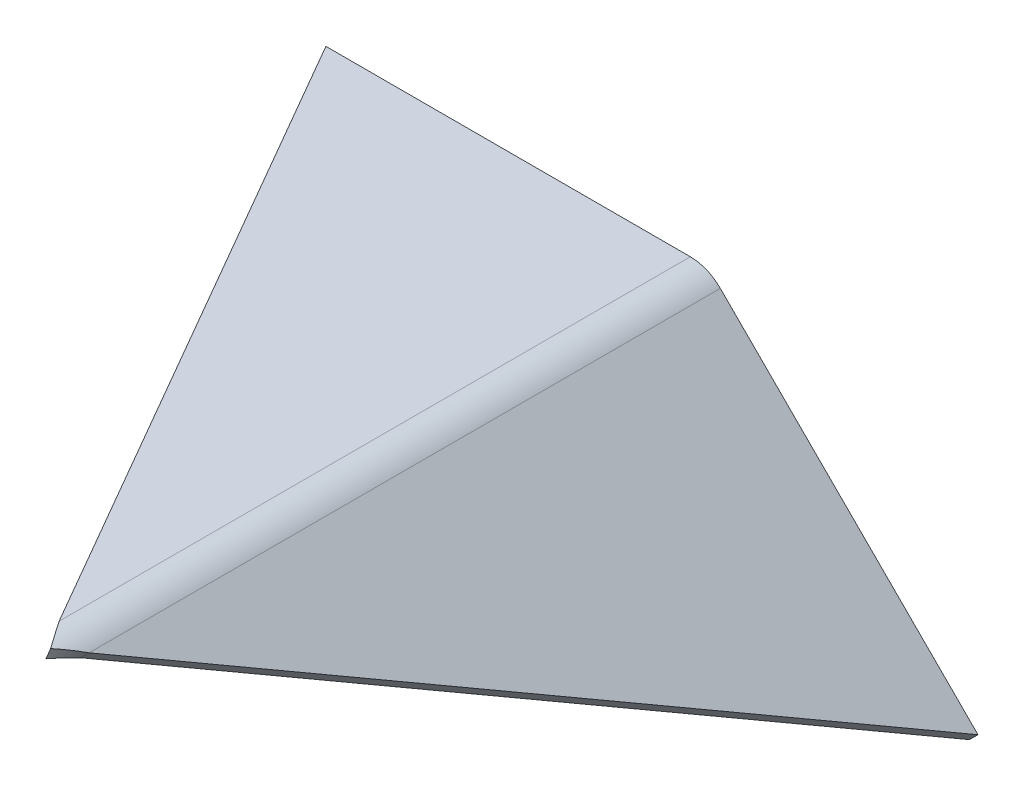
ISO-10303-21;
HEADER;
FILE_DESCRIPTION(('STEP AP214'),'2;1');
FILE_NAME('part.step','',(''),(''),'','','');
FILE_SCHEMA(('AUTOMOTIVE_DESIGN { 1 0 10303 214 1 1 1 1 }'));
ENDSEC;
DATA;
#1=APPLICATION_CONTEXT('core data for automotive mechanical design processes');
#2=APPLICATION_PROTOCOL_DEFINITION('international standard','automotive_design',2000,#1);
#3=PRODUCT_CONTEXT('',#1,'mechanical');
#4=PRODUCT('Part','Part','',(#3));
#5=PRODUCT_RELATED_PRODUCT_CATEGORY('part','',(#4));
#6=PRODUCT_DEFINITION_FORMATION('','',#4);
#7=PRODUCT_DEFINITION_CONTEXT('part definition',#1,'design');
#8=PRODUCT_DEFINITION('design','',#6,#7);
#9=PRODUCT_DEFINITION_SHAPE('','',#8);
#10=(LENGTH_UNIT() NAMED_UNIT(*) SI_UNIT(.MILLI.,.METRE.));
#11=(NAMED_UNIT(*) PLANE_ANGLE_UNIT() SI_UNIT($,.RADIAN.));
#12=(NAMED_UNIT(*) SI_UNIT($,.STERADIAN.) SOLID_ANGLE_UNIT());
#13=UNCERTAINTY_MEASURE_WITH_UNIT(LENGTH_MEASURE(1.E-05),#10,'distance_accuracy_value','');
#14=(GEOMETRIC_REPRESENTATION_CONTEXT(3) GLOBAL_UNCERTAINTY_ASSIGNED_CONTEXT((#13)) GLOBAL_UNIT_ASSIGNED_CONTEXT((#10,
#11,#12)) REPRESENTATION_CONTEXT('',''));
#15=CARTESIAN_POINT('',(0.,0.,0.));
#16=DIRECTION('',(0.,0.,1.));
#17=DIRECTION('',(1.,0.,0.));
#18=AXIS2_PLACEMENT_3D('',#15,#16,#17);
#19=CARTESIAN_POINT('',(90.2432914009265,-89.1566905080881,-216.50635094611));
#20=DIRECTION('',(-0.612372435695794,0.612372435695796,-0.5));
#21=DIRECTION('',(0.353553390593273,-0.353553390593274,-0.866025403784439));
#22=AXIS2_PLACEMENT_3D('',#19,#20,#21);
#23=PLANE('',#22);
#24=CARTESIAN_POINT('',(2.35867883148077,-6.92893218813451,-8.16209713905391));
#25=CARTESIAN_POINT('',(5.18710595622695,-4.10050506338832,-8.16209713905391));
#26=B_SPLINE_CURVE_WITH_KNOTS('',1,(#24,#25),.UNSPECIFIED.,.F.,.F.,(2,2),(0.,1.),.UNSPECIFIED.);
#27=CARTESIAN_POINT('',(2.35867883148075,-6.92893218813454,-8.16209713905391));
#28=VERTEX_POINT('',#27);
#29=CARTESIAN_POINT('',(5.18710595622697,-4.10050506338834,-8.16209713905391));
#30=VERTEX_POINT('',#29);
#31=EDGE_CURVE('E11',#28,#30,#26,.T.);
#32=ORIENTED_EDGE('',*,*,#31,.F.);
#33=DIRECTION('',(0.353553390593273,-0.353553390593274,-0.866025403784439));
#34=VECTOR('',#33,1.);
#35=CARTESIAN_POINT('',(87.4148642761803,-91.9851176328343,-216.50635094611));
#36=LINE('',#35,#34);
#37=CARTESIAN_POINT('',(87.4148642761803,-91.9851176328343,-216.50635094611));
#38=VERTEX_POINT('',#37);
#39=EDGE_CURVE('E96',#28,#38,#36,.T.);
#40=ORIENTED_EDGE('',*,*,#39,.T.);
#41=DIRECTION('',(0.707106781186549,0.707106781186546,0.));
#42=VECTOR('',#41,1.);
#43=CARTESIAN_POINT('',(90.2432914009265,-89.1566905080881,-216.50635094611));
#44=LINE('',#43,#42);
#45=CARTESIAN_POINT('',(90.2432914009265,-89.1566905080881,-216.50635094611));
#46=VERTEX_POINT('',#45);
#47=EDGE_CURVE('E57',#38,#46,#44,.T.);
#48=ORIENTED_EDGE('',*,*,#47,.T.);
#49=DIRECTION('',(0.353553390593273,-0.353553390593274,-0.866025403784439));
#50=VECTOR('',#49,1.);
#51=CARTESIAN_POINT('',(90.2432914009265,-89.1566905080881,-216.50635094611));
#52=LINE('',#51,#50);
#53=EDGE_CURVE('E99',#30,#46,#52,.T.);
#54=ORIENTED_EDGE('',*,*,#53,.F.);
#55=EDGE_LOOP('',(#32,#40,#48,#54));
#56=FACE_BOUND('',#55,.T.);
#57=ADVANCED_FACE('F43',(#56),#23,.F.);
#58=CARTESIAN_POINT('',(-86.5334038957101,87.620004788549,-216.50635094611));
#59=DIRECTION('',(0.,0.,1.));
#60=DIRECTION('',(-0.707106781186546,0.707106781186549,0.));
#61=AXIS2_PLACEMENT_3D('',#58,#59,#60);
#62=PLANE('',#61);
#63=ORIENTED_EDGE('',*,*,#47,.F.);
#64=DIRECTION('',(0.707106781186546,-0.707106781186549,0.));
#65=VECTOR('',#64,1.);
#66=CARTESIAN_POINT('',(-0.973483372138,-3.59676998451578,-216.50635094611));
#67=LINE('',#66,#65);
#68=CARTESIAN_POINT('',(2.35867883148078,-6.92893218813453,-216.50635094611));
#69=VERTEX_POINT('',#68);
#70=EDGE_CURVE('E126',#38,#69,#67,.F.);
#71=ORIENTED_EDGE('',*,*,#70,.T.);
#72=DIRECTION('',(0.707106781186548,0.707106781186547,0.));
#73=VECTOR('',#72,1.);
#74=CARTESIAN_POINT('',(5.18710595622697,-4.10050506338834,-216.50635094611));
#75=LINE('',#74,#73);
#76=CARTESIAN_POINT('',(5.18710595622697,-4.10050506338834,-216.50635094611));
#77=VERTEX_POINT('',#76);
#78=EDGE_CURVE('E412',#69,#77,#75,.T.);
#79=ORIENTED_EDGE('',*,*,#78,.T.);
#80=DIRECTION('',(-0.707106781186546,0.707106781186549,0.));
#81=VECTOR('',#80,1.);
#82=CARTESIAN_POINT('',(-86.5334038957101,87.620004788549,-216.50635094611));
#83=LINE('',#82,#81);
#84=EDGE_CURVE('E392',#46,#77,#83,.T.);
#85=ORIENTED_EDGE('',*,*,#84,.F.);
#86=EDGE_LOOP('',(#63,#71,#79,#85));
#87=FACE_BOUND('',#86,.T.);
#88=ADVANCED_FACE('F178',(#87),#62,.F.);
#89=CARTESIAN_POINT('',(-4.7123889803847,-14.,-216.50635094611));
#90=DIRECTION('',(0.,0.,-1.));
#91=DIRECTION('',(-1.,0.,0.));
#92=AXIS2_PLACEMENT_3D('',#89,#90,#91);
#93=PLANE('',#92);
#94=ORIENTED_EDGE('',*,*,#78,.F.);
#95=CARTESIAN_POINT('',(-4.7123889803847,-14.,-216.50635094611));
#96=DIRECTION('',(0.,0.,1.));
#97=DIRECTION('',(1.,0.,0.));
#98=AXIS2_PLACEMENT_3D('',#95,#96,#97);
#99=CIRCLE('',#98,10.);
#100=CARTESIAN_POINT('',(-4.7123889803847,-4.,-216.50635094611));
#101=VERTEX_POINT('',#100);
#102=EDGE_CURVE('E119',#101,#69,#99,.F.);
#103=ORIENTED_EDGE('',*,*,#102,.F.);
#104=DIRECTION('',(0.,1.,0.));
#105=VECTOR('',#104,1.);
#106=CARTESIAN_POINT('',(-4.7123889803847,0.,-216.50635094611));
#107=LINE('',#106,#105);
#108=CARTESIAN_POINT('',(-4.7123889803847,0.,-216.50635094611));
#109=VERTEX_POINT('',#108);
#110=EDGE_CURVE('E409',#101,#109,#107,.T.);
#111=ORIENTED_EDGE('',*,*,#110,.T.);
#112=CARTESIAN_POINT('',(-4.7123889803847,-14.,-216.50635094611));
#113=DIRECTION('',(0.,0.,1.));
#114=DIRECTION('',(1.,0.,0.));
#115=AXIS2_PLACEMENT_3D('',#112,#113,#114);
#116=CIRCLE('',#115,14.);
#117=EDGE_CURVE('E389',#109,#77,#116,.F.);
#118=ORIENTED_EDGE('',*,*,#117,.T.);
#119=EDGE_LOOP('',(#94,#103,#111,#118));
#120=FACE_BOUND('',#119,.T.);
#121=ADVANCED_FACE('F174',(#120),#93,.T.);
#122=CARTESIAN_POINT('',(-125.,0.,-216.50635094611));
#123=DIRECTION('',(0.,0.,1.));
#124=DIRECTION('',(-1.,0.,0.));
#125=AXIS2_PLACEMENT_3D('',#122,#123,#124);
#126=PLANE('',#125);
#127=ORIENTED_EDGE('',*,*,#110,.F.);
#128=DIRECTION('',(1.,0.,0.));
#129=VECTOR('',#128,1.);
#130=CARTESIAN_POINT('',(0.,-4.,-216.50635094611));
#131=LINE('',#130,#129);
#132=CARTESIAN_POINT('',(-125.,-4.,-216.50635094611));
#133=VERTEX_POINT('',#132);
#134=EDGE_CURVE('E123',#101,#133,#131,.F.);
#135=ORIENTED_EDGE('',*,*,#134,.T.);
#136=DIRECTION('',(0.,1.,0.));
#137=VECTOR('',#136,1.);
#138=CARTESIAN_POINT('',(-125.,0.,-216.50635094611));
#139=LINE('',#138,#137);
#140=CARTESIAN_POINT('',(-125.,0.,-216.50635094611));
#141=VERTEX_POINT('',#140);
#142=EDGE_CURVE('E403',#133,#141,#139,.T.);
#143=ORIENTED_EDGE('',*,*,#142,.T.);
#144=DIRECTION('',(-1.,0.,0.));
#145=VECTOR('',#144,1.);
#146=CARTESIAN_POINT('',(-125.,0.,-216.50635094611));
#147=LINE('',#146,#145);
#148=EDGE_CURVE('E434',#109,#141,#147,.T.);
#149=ORIENTED_EDGE('',*,*,#148,.F.);
#150=EDGE_LOOP('',(#127,#135,#143,#149));
#151=FACE_BOUND('',#150,.T.);
#152=ADVANCED_FACE('F167',(#151),#126,.F.);
#153=CARTESIAN_POINT('',(0.,0.,0.));
#154=DIRECTION('',(0.866025403784438,0.,-0.5));
#155=DIRECTION('',(0.5,0.,0.866025403784439));
#156=AXIS2_PLACEMENT_3D('',#153,#154,#155);
#157=PLANE('',#156);
#158=ORIENTED_EDGE('',*,*,#142,.F.);
#159=DIRECTION('',(0.5,0.,0.866025403784439));
#160=VECTOR('',#159,1.);
#161=CARTESIAN_POINT('',(0.,-4.,0.));
#162=LINE('',#161,#160);
#163=CARTESIAN_POINT('',(-4.7123889803847,-4.,-8.16209713905399));
#164=VERTEX_POINT('',#163);
#165=EDGE_CURVE('E357',#133,#164,#162,.T.);
#166=ORIENTED_EDGE('',*,*,#165,.T.);
#167=CARTESIAN_POINT('',(-4.7123889803847,0.,-8.16209713905397));
#168=CARTESIAN_POINT('',(-4.7123889803847,-4.,-8.16209713905397));
#169=B_SPLINE_CURVE_WITH_KNOTS('',1,(#167,#168),.UNSPECIFIED.,.F.,.F.,(2,2),(0.,1.),.UNSPECIFIED.);
#170=CARTESIAN_POINT('',(-4.7123889803847,0.,-8.16209713905399));
#171=VERTEX_POINT('',#170);
#172=EDGE_CURVE('E149',#164,#171,#169,.F.);
#173=ORIENTED_EDGE('',*,*,#172,.T.);
#174=DIRECTION('',(0.5,0.,0.866025403784439));
#175=VECTOR('',#174,1.);
#176=CARTESIAN_POINT('',(0.,0.,0.));
#177=LINE('',#176,#175);
#178=EDGE_CURVE('E411',#141,#171,#177,.T.);
#179=ORIENTED_EDGE('',*,*,#178,.F.);
#180=EDGE_LOOP('',(#158,#166,#173,#179));
#181=FACE_BOUND('',#180,.T.);
#182=ADVANCED_FACE('F156',(#181),#157,.F.);
#183=CARTESIAN_POINT('',(0.645179014249225,-1.06568652061988,-9.39693323154245E-08));
#184=CARTESIAN_POINT('',(-1.04827574731532,-0.364234600084442,-2.72127295505337));
#185=CARTESIAN_POINT('',(-2.87940675835187,0.,-5.44082427796996));
#186=CARTESIAN_POINT('',(-4.7123889803847,0.,-8.16209713905397));
#187=CARTESIAN_POINT('',(-0.885554698503325,-4.76120465758563,-9.39693323154245E-08));
#188=CARTESIAN_POINT('',(-2.09506798963428,-4.26020785493522,-2.72105416436443));
#189=CARTESIAN_POINT('',(-3.40322123036626,-4.,-5.4410430686589));
#190=CARTESIAN_POINT('',(-4.7123889803847,-4.,-8.16209713905397));
#191=B_SPLINE_SURFACE_WITH_KNOTS('',1,3,((#183,#184,#185,#186),(#187,#188,#189,#190)),
.UNSPECIFIED.,.F.,.F.,.F.,(2,2),(4,4),(0.,1.),(1.15128904621129E-08,1.),.UNSPECIFIED.);
#192=CARTESIAN_POINT('',(-4.7123889803847,-4.,-8.16209713905397));
#193=CARTESIAN_POINT('',(-3.40322123036626,-4.,-5.4410430686589));
#194=CARTESIAN_POINT('',(-2.09506798963428,-4.26020785493522,-2.72105416436443));
#195=CARTESIAN_POINT('',(-0.885554698503325,-4.76120465758563,-9.39693323154245E-08));
#196=B_SPLINE_CURVE_WITH_KNOTS('',3,(#192,#193,#194,#195),.UNSPECIFIED.,.F.,.F.,(4,4),
(1.15128904187856E-08,1.),.UNSPECIFIED.);
#197=CARTESIAN_POINT('',(-0.885554545584359,-4.76120472092674,-2.5005397752409E-07));
#198=VERTEX_POINT('',#197);
#199=EDGE_CURVE('E129',#198,#164,#196,.F.);
#200=CARTESIAN_POINT('',(-0.885554698503325,-4.76120465758563,-9.39693323154245E-08));
#201=CARTESIAN_POINT('',(0.645179014249225,-1.06568652061988,-9.39693323154245E-08));
#202=B_SPLINE_CURVE_WITH_KNOTS('',1,(#200,#201),.UNSPECIFIED.,.F.,.F.,(2,2),(0.,1.),.UNSPECIFIED.);
#203=CARTESIAN_POINT('',(0.645179228335777,-1.06568660929744,-2.5005397752409E-07));
#204=VERTEX_POINT('',#203);
#205=EDGE_CURVE('E65',#198,#204,#202,.T.);
#206=CARTESIAN_POINT('',(0.645179014249225,-1.06568652061988,-9.39693323154245E-08));
#207=CARTESIAN_POINT('',(-1.04827574731532,-0.364234600084442,-2.72127295505337));
#208=CARTESIAN_POINT('',(-2.87940675835187,0.,-5.44082427796996));
#209=CARTESIAN_POINT('',(-4.7123889803847,0.,-8.16209713905397));
#210=B_SPLINE_CURVE_WITH_KNOTS('',3,(#206,#207,#208,#209),.UNSPECIFIED.,.F.,.F.,(4,4),
(1.15128904621129E-08,1.),.UNSPECIFIED.);
#211=EDGE_CURVE('E368',#204,#171,#210,.T.);
#212=ORIENTED_EDGE('',*,*,#172,.F.);
#213=ORIENTED_EDGE('',*,*,#199,.F.);
#214=ORIENTED_EDGE('',*,*,#205,.T.);
#215=ORIENTED_EDGE('',*,*,#211,.T.);
#216=EDGE_LOOP('',(#212,#213,#214,#215));
#217=FACE_BOUND('',#216,.T.);
#218=ADVANCED_FACE('F166',(#217),#191,.F.);
#219=CARTESIAN_POINT('',(5.18710595622695,-4.10050506338832,-8.16209713905391));
#220=CARTESIAN_POINT('',(3.890991822039,-2.80439092920037,-5.44082433005133));
#221=CARTESIAN_POINT('',(2.33863394587959,-1.76713854443782,-2.72127305905658));
#222=CARTESIAN_POINT('',(0.645179228335772,-1.06568660929743,-2.5005397752409E-07));
#223=CARTESIAN_POINT('',(2.35867883148077,-6.92893218813451,-8.16209713905391));
#224=CARTESIAN_POINT('',(1.43295745544367,-6.00321081209742,-5.44104312072033));
#225=CARTESIAN_POINT('',(0.323958714112757,-5.26220153401132,-2.72105426838759));
#226=CARTESIAN_POINT('',(-0.885554545584363,-4.76120472092674,-2.5005397752409E-07));
#227=B_SPLINE_SURFACE_WITH_KNOTS('',1,3,((#219,#220,#221,#222),(#223,#224,#225,#226)),
.UNSPECIFIED.,.F.,.F.,.F.,(2,2),(4,4),(0.,1.),(0.,0.999999969364003),.UNSPECIFIED.);
#228=CARTESIAN_POINT('',(-0.885554545584363,-4.76120472092674,-2.5005397752409E-07));
#229=CARTESIAN_POINT('',(0.323958714112757,-5.26220153401132,-2.72105426838759));
#230=CARTESIAN_POINT('',(1.43295745544367,-6.00321081209742,-5.44104312072033));
#231=CARTESIAN_POINT('',(2.35867883148077,-6.92893218813451,-8.16209713905391));
#232=B_SPLINE_CURVE_WITH_KNOTS('',3,(#228,#229,#230,#231),.UNSPECIFIED.,.F.,.F.,(4,4),(0.,
0.999999969364003),.UNSPECIFIED.);
#233=EDGE_CURVE('E116',#28,#198,#232,.F.);
#234=CARTESIAN_POINT('',(5.18710595622695,-4.10050506338832,-8.16209713905391));
#235=CARTESIAN_POINT('',(3.890991822039,-2.80439092920037,-5.44082433005133));
#236=CARTESIAN_POINT('',(2.33863394587959,-1.76713854443782,-2.72127305905658));
#237=CARTESIAN_POINT('',(0.645179228335772,-1.06568660929743,-2.5005397752409E-07));
#238=B_SPLINE_CURVE_WITH_KNOTS('',3,(#234,#235,#236,#237),.UNSPECIFIED.,.F.,.F.,(4,4),(0.,
0.999999969364003),.UNSPECIFIED.);
#239=EDGE_CURVE('E386',#30,#204,#238,.T.);
#240=ORIENTED_EDGE('',*,*,#233,.F.);
#241=ORIENTED_EDGE('',*,*,#31,.T.);
#242=ORIENTED_EDGE('',*,*,#239,.T.);
#243=ORIENTED_EDGE('',*,*,#205,.F.);
#244=EDGE_LOOP('',(#240,#241,#242,#243));
#245=FACE_BOUND('',#244,.T.);
#246=ADVANCED_FACE('F45',(#245),#227,.F.);
#247=CARTESIAN_POINT('',(-4.7123889803847,-14.,-329.082526088088));
#248=DIRECTION('',(0.,0.,1.));
#249=DIRECTION('',(1.,0.,0.));
#250=AXIS2_PLACEMENT_3D('',#247,#248,#249);
#251=CYLINDRICAL_SURFACE('',#250,14.);
#252=DIRECTION('',(0.,0.,-1.));
#253=VECTOR('',#252,1.);
#254=CARTESIAN_POINT('',(-4.7123889803847,0.,0.));
#255=LINE('',#254,#253);
#256=EDGE_CURVE('E436',#171,#109,#255,.T.);
#257=ORIENTED_EDGE('',*,*,#256,.F.);
#258=ORIENTED_EDGE('',*,*,#211,.F.);
#259=ORIENTED_EDGE('',*,*,#239,.F.);
#260=DIRECTION('',(0.,0.,-1.));
#261=VECTOR('',#260,1.);
#262=CARTESIAN_POINT('',(5.18710595622697,-4.10050506338838,0.));
#263=LINE('',#262,#261);
#264=EDGE_CURVE('E396',#30,#77,#263,.T.);
#265=ORIENTED_EDGE('',*,*,#264,.T.);
#266=ORIENTED_EDGE('',*,*,#117,.F.);
#267=EDGE_LOOP('',(#257,#258,#259,#265,#266));
#268=FACE_BOUND('',#267,.T.);
#269=ADVANCED_FACE('F232',(#268),#251,.T.);
#270=CARTESIAN_POINT('',(1.8549437526082,-0.768342859769591,0.));
#271=DIRECTION('',(-0.707106781186549,-0.707106781186546,0.));
#272=DIRECTION('',(0.,0.,-1.));
#273=AXIS2_PLACEMENT_3D('',#270,#271,#272);
#274=PLANE('',#273);
#275=ORIENTED_EDGE('',*,*,#264,.F.);
#276=ORIENTED_EDGE('',*,*,#53,.T.);
#277=ORIENTED_EDGE('',*,*,#84,.T.);
#278=EDGE_LOOP('',(#275,#276,#277));
#279=FACE_BOUND('',#278,.T.);
#280=ADVANCED_FACE('F242',(#279),#274,.F.);
#281=CARTESIAN_POINT('',(0.,0.,0.));
#282=DIRECTION('',(0.,-1.,0.));
#283=DIRECTION('',(0.,0.,-1.));
#284=AXIS2_PLACEMENT_3D('',#281,#282,#283);
#285=PLANE('',#284);
#286=ORIENTED_EDGE('',*,*,#178,.T.);
#287=ORIENTED_EDGE('',*,*,#256,.T.);
#288=ORIENTED_EDGE('',*,*,#148,.T.);
#289=EDGE_LOOP('',(#286,#287,#288));
#290=FACE_BOUND('',#289,.T.);
#291=ADVANCED_FACE('F251',(#290),#285,.F.);
#292=CARTESIAN_POINT('',(-4.7123889803847,-14.,-329.082526088088));
#293=DIRECTION('',(0.,0.,1.));
#294=DIRECTION('',(1.,0.,0.));
#295=AXIS2_PLACEMENT_3D('',#292,#293,#294);
#296=CYLINDRICAL_SURFACE('',#295,10.);
#297=DIRECTION('',(0.,0.,-1.));
#298=VECTOR('',#297,1.);
#299=CARTESIAN_POINT('',(-4.7123889803847,-4.,0.));
#300=LINE('',#299,#298);
#301=EDGE_CURVE('E350',#164,#101,#300,.T.);
#302=ORIENTED_EDGE('',*,*,#301,.T.);
#303=ORIENTED_EDGE('',*,*,#102,.T.);
#304=DIRECTION('',(0.,0.,1.));
#305=VECTOR('',#304,1.);
#306=CARTESIAN_POINT('',(2.35867883148079,-6.92893218813454,-329.082526088088));
#307=LINE('',#306,#305);
#308=EDGE_CURVE('E112',#28,#69,#307,.F.);
#309=ORIENTED_EDGE('',*,*,#308,.F.);
#310=ORIENTED_EDGE('',*,*,#233,.T.);
#311=ORIENTED_EDGE('',*,*,#199,.T.);
#312=EDGE_LOOP('',(#302,#303,#309,#310,#311));
#313=FACE_BOUND('',#312,.T.);
#314=ADVANCED_FACE('F114',(#313),#296,.F.);
#315=CARTESIAN_POINT('',(-0.973483372138,-3.59676998451578,0.));
#316=DIRECTION('',(-0.707106781186549,-0.707106781186546,0.));
#317=DIRECTION('',(0.,0.,-1.));
#318=AXIS2_PLACEMENT_3D('',#315,#316,#317);
#319=PLANE('',#318);
#320=ORIENTED_EDGE('',*,*,#308,.T.);
#321=ORIENTED_EDGE('',*,*,#70,.F.);
#322=ORIENTED_EDGE('',*,*,#39,.F.);
#323=EDGE_LOOP('',(#320,#321,#322));
#324=FACE_BOUND('',#323,.T.);
#325=ADVANCED_FACE('F125',(#324),#319,.T.);
#326=CARTESIAN_POINT('',(0.,-4.,0.));
#327=DIRECTION('',(0.,-1.,0.));
#328=DIRECTION('',(0.,0.,-1.));
#329=AXIS2_PLACEMENT_3D('',#326,#327,#328);
#330=PLANE('',#329);
#331=ORIENTED_EDGE('',*,*,#165,.F.);
#332=ORIENTED_EDGE('',*,*,#134,.F.);
#333=ORIENTED_EDGE('',*,*,#301,.F.);
#334=EDGE_LOOP('',(#331,#332,#333));
#335=FACE_BOUND('',#334,.T.);
#336=ADVANCED_FACE('F205',(#335),#330,.T.);
#337=CLOSED_SHELL('',(#57,#88,#121,#152,#182,#218,#246,#269,#280,#291,#314,#325,#336));
#338=MANIFOLD_SOLID_BREP('B2',#337);
#339=ADVANCED_BREP_SHAPE_REPRESENTATION('',(#18,#338),#14);
#340=SHAPE_DEFINITION_REPRESENTATION(#9,#339);
ENDSEC;
END-ISO-10303-21;
